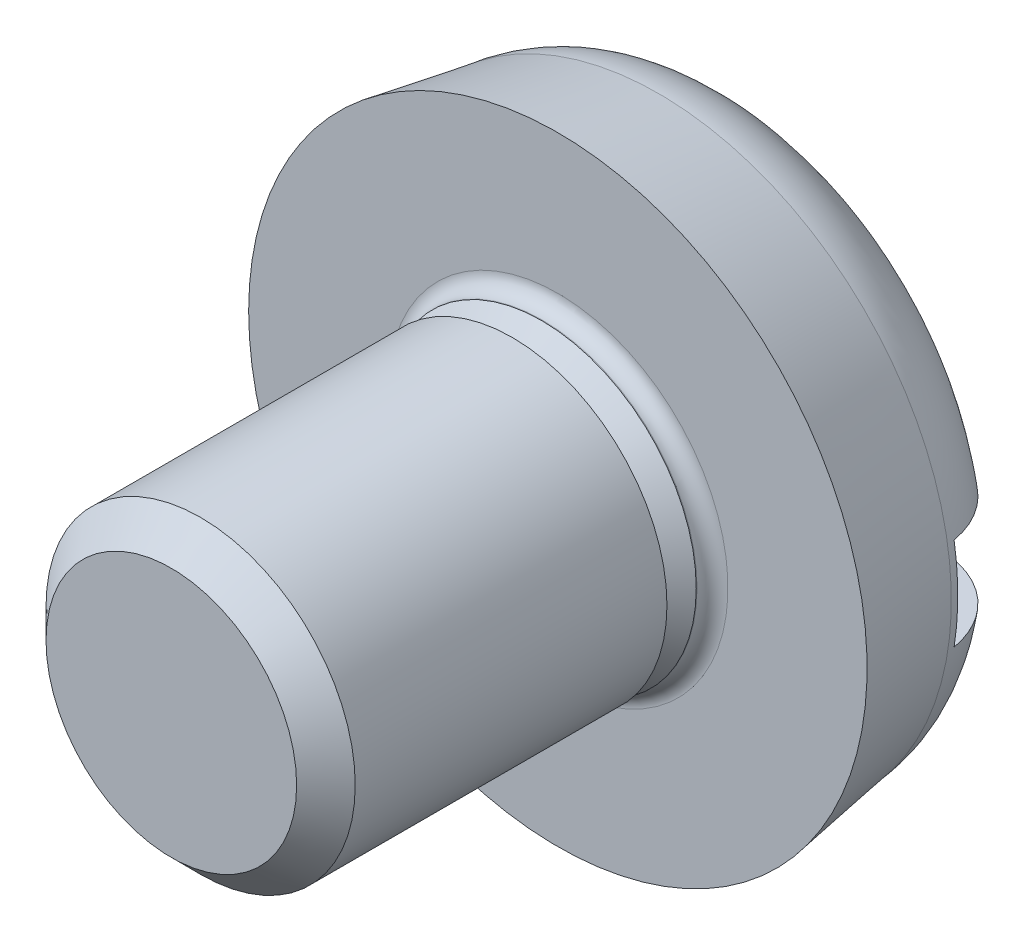
ISO-10303-21;
HEADER;
FILE_DESCRIPTION(('STEP AP214'),'2;1');
FILE_NAME('part.step','',(''),(''),'','','');
FILE_SCHEMA(('AUTOMOTIVE_DESIGN { 1 0 10303 214 1 1 1 1 }'));
ENDSEC;
DATA;
#1=APPLICATION_CONTEXT('core data for automotive mechanical design processes');
#2=APPLICATION_PROTOCOL_DEFINITION('international standard','automotive_design',2000,#1);
#3=PRODUCT_CONTEXT('',#1,'mechanical');
#4=PRODUCT('Part','Part','',(#3));
#5=PRODUCT_RELATED_PRODUCT_CATEGORY('part','',(#4));
#6=PRODUCT_DEFINITION_FORMATION('','',#4);
#7=PRODUCT_DEFINITION_CONTEXT('part definition',#1,'design');
#8=PRODUCT_DEFINITION('design','',#6,#7);
#9=PRODUCT_DEFINITION_SHAPE('','',#8);
#10=(LENGTH_UNIT() NAMED_UNIT(*) SI_UNIT(.MILLI.,.METRE.));
#11=(NAMED_UNIT(*) PLANE_ANGLE_UNIT() SI_UNIT($,.RADIAN.));
#12=(NAMED_UNIT(*) SI_UNIT($,.STERADIAN.) SOLID_ANGLE_UNIT());
#13=UNCERTAINTY_MEASURE_WITH_UNIT(LENGTH_MEASURE(1.E-05),#10,'distance_accuracy_value','');
#14=(GEOMETRIC_REPRESENTATION_CONTEXT(3) GLOBAL_UNCERTAINTY_ASSIGNED_CONTEXT((#13)) GLOBAL_UNIT_ASSIGNED_CONTEXT((#10,
#11,#12)) REPRESENTATION_CONTEXT('',''));
#15=CARTESIAN_POINT('',(0.,0.,0.));
#16=DIRECTION('',(0.,0.,1.));
#17=DIRECTION('',(1.,0.,0.));
#18=AXIS2_PLACEMENT_3D('',#15,#16,#17);
#19=CARTESIAN_POINT('',(0.,0.,0.));
#20=DIRECTION('',(0.,0.,-1.));
#21=DIRECTION('',(-1.,0.,0.));
#22=AXIS2_PLACEMENT_3D('',#19,#20,#21);
#23=PLANE('',#22);
#24=DIRECTION('',(-1.,0.,0.));
#25=VECTOR('',#24,1.);
#26=CARTESIAN_POINT('',(0.,-0.6,0.));
#27=LINE('',#26,#25);
#28=CARTESIAN_POINT('',(2.51957157782548,-0.6,0.));
#29=VERTEX_POINT('',#28);
#30=CARTESIAN_POINT('',(-2.51957157782548,-0.6,0.));
#31=VERTEX_POINT('',#30);
#32=EDGE_CURVE('E39',#29,#31,#27,.T.);
#33=ORIENTED_EDGE('',*,*,#32,.F.);
#34=CARTESIAN_POINT('',(0.,0.,0.));
#35=DIRECTION('',(0.,0.,-1.));
#36=DIRECTION('',(-1.,0.,0.));
#37=AXIS2_PLACEMENT_3D('',#34,#35,#36);
#38=CIRCLE('',#37,2.59002720753779);
#39=EDGE_CURVE('E130',#29,#31,#38,.T.);
#40=ORIENTED_EDGE('',*,*,#39,.T.);
#41=EDGE_LOOP('',(#33,#40));
#42=FACE_BOUND('',#41,.T.);
#43=ADVANCED_FACE('F15',(#42),#23,.T.);
#44=CARTESIAN_POINT('',(0.,0.,7.4));
#45=DIRECTION('',(0.,0.,-1.));
#46=DIRECTION('',(-1.,0.,0.));
#47=AXIS2_PLACEMENT_3D('',#44,#45,#46);
#48=PLANE('',#47);
#49=CARTESIAN_POINT('',(0.,0.,7.4));
#50=DIRECTION('',(0.,0.,-1.));
#51=DIRECTION('',(-1.,0.,0.));
#52=AXIS2_PLACEMENT_3D('',#49,#50,#51);
#53=CIRCLE('',#52,1.621125);
#54=CARTESIAN_POINT('',(-1.621125,0.,7.4));
#55=VERTEX_POINT('',#54);
#56=EDGE_CURVE('E89',#55,#55,#53,.T.);
#57=ORIENTED_EDGE('',*,*,#56,.F.);
#58=EDGE_LOOP('',(#57));
#59=FACE_BOUND('',#58,.T.);
#60=ADVANCED_FACE('F17',(#59),#48,.F.);
#61=CARTESIAN_POINT('',(0.,0.,7.4));
#62=DIRECTION('',(0.,0.,-1.));
#63=DIRECTION('',(-1.,0.,0.));
#64=AXIS2_PLACEMENT_3D('',#61,#62,#63);
#65=CONICAL_SURFACE('',#64,1.621125,0.785398163397449);
#66=CARTESIAN_POINT('',(0.,0.,7.021125));
#67=DIRECTION('',(0.,0.,-1.));
#68=DIRECTION('',(-1.,0.,0.));
#69=AXIS2_PLACEMENT_3D('',#66,#67,#68);
#70=CIRCLE('',#69,2.);
#71=CARTESIAN_POINT('',(-2.,0.,7.021125));
#72=VERTEX_POINT('',#71);
#73=EDGE_CURVE('E95',#72,#72,#70,.T.);
#74=ORIENTED_EDGE('',*,*,#73,.F.);
#75=EDGE_LOOP('',(#74));
#76=FACE_BOUND('',#75,.T.);
#77=ORIENTED_EDGE('',*,*,#56,.T.);
#78=EDGE_LOOP('',(#77));
#79=FACE_BOUND('',#78,.T.);
#80=ADVANCED_FACE('F162',(#76,#79),#65,.T.);
#81=CARTESIAN_POINT('',(0.,0.,0.));
#82=DIRECTION('',(0.,0.,-1.));
#83=DIRECTION('',(-1.,0.,0.));
#84=AXIS2_PLACEMENT_3D('',#81,#82,#83);
#85=CYLINDRICAL_SURFACE('',#84,2.);
#86=CARTESIAN_POINT('',(0.,0.,2.988875));
#87=DIRECTION('',(0.,0.,-1.));
#88=DIRECTION('',(-1.,0.,0.));
#89=AXIS2_PLACEMENT_3D('',#86,#87,#88);
#90=CIRCLE('',#89,2.);
#91=CARTESIAN_POINT('',(-2.,0.,2.988875));
#92=VERTEX_POINT('',#91);
#93=EDGE_CURVE('E99',#92,#92,#90,.T.);
#94=ORIENTED_EDGE('',*,*,#93,.F.);
#95=EDGE_LOOP('',(#94));
#96=FACE_BOUND('',#95,.T.);
#97=ORIENTED_EDGE('',*,*,#73,.T.);
#98=EDGE_LOOP('',(#97));
#99=FACE_BOUND('',#98,.T.);
#100=ADVANCED_FACE('F179',(#96,#99),#85,.T.);
#101=CARTESIAN_POINT('',(0.,2.,2.988875));
#102=DIRECTION('',(0.,0.,1.));
#103=DIRECTION('',(1.,0.,0.));
#104=AXIS2_PLACEMENT_3D('',#101,#102,#103);
#105=PLANE('',#104);
#106=CARTESIAN_POINT('',(0.,0.,2.988875));
#107=DIRECTION('',(0.,0.,-1.));
#108=DIRECTION('',(-1.,0.,0.));
#109=AXIS2_PLACEMENT_3D('',#106,#107,#108);
#110=CIRCLE('',#109,1.621125);
#111=CARTESIAN_POINT('',(-1.621125,0.,2.988875));
#112=VERTEX_POINT('',#111);
#113=EDGE_CURVE('E103',#112,#112,#110,.T.);
#114=ORIENTED_EDGE('',*,*,#113,.F.);
#115=EDGE_LOOP('',(#114));
#116=FACE_BOUND('',#115,.T.);
#117=ORIENTED_EDGE('',*,*,#93,.T.);
#118=EDGE_LOOP('',(#117));
#119=FACE_BOUND('',#118,.T.);
#120=ADVANCED_FACE('F188',(#116,#119),#105,.F.);
#121=CARTESIAN_POINT('',(0.,0.,2.988875));
#122=DIRECTION('',(0.,0.,-1.));
#123=DIRECTION('',(-1.,0.,0.));
#124=AXIS2_PLACEMENT_3D('',#121,#122,#123);
#125=CONICAL_SURFACE('',#124,1.621125,0.785398163397449);
#126=CARTESIAN_POINT('',(0.,0.,2.61));
#127=DIRECTION('',(0.,0.,-1.));
#128=DIRECTION('',(-1.,0.,0.));
#129=AXIS2_PLACEMENT_3D('',#126,#127,#128);
#130=CIRCLE('',#129,2.);
#131=CARTESIAN_POINT('',(-2.,0.,2.61));
#132=VERTEX_POINT('',#131);
#133=EDGE_CURVE('E107',#132,#132,#130,.T.);
#134=ORIENTED_EDGE('',*,*,#133,.F.);
#135=EDGE_LOOP('',(#134));
#136=FACE_BOUND('',#135,.T.);
#137=ORIENTED_EDGE('',*,*,#113,.T.);
#138=EDGE_LOOP('',(#137));
#139=FACE_BOUND('',#138,.T.);
#140=ADVANCED_FACE('F198',(#136,#139),#125,.T.);
#141=CARTESIAN_POINT('',(0.,0.,0.));
#142=DIRECTION('',(0.,0.,-1.));
#143=DIRECTION('',(-1.,0.,0.));
#144=AXIS2_PLACEMENT_3D('',#141,#142,#143);
#145=CYLINDRICAL_SURFACE('',#144,2.);
#146=CARTESIAN_POINT('',(0.,0.,2.6));
#147=DIRECTION('',(0.,0.,-1.));
#148=DIRECTION('',(-1.,0.,0.));
#149=AXIS2_PLACEMENT_3D('',#146,#147,#148);
#150=CIRCLE('',#149,2.);
#151=CARTESIAN_POINT('',(-2.,0.,2.6));
#152=VERTEX_POINT('',#151);
#153=EDGE_CURVE('E111',#152,#152,#150,.T.);
#154=ORIENTED_EDGE('',*,*,#153,.F.);
#155=EDGE_LOOP('',(#154));
#156=FACE_BOUND('',#155,.T.);
#157=ORIENTED_EDGE('',*,*,#133,.T.);
#158=EDGE_LOOP('',(#157));
#159=FACE_BOUND('',#158,.T.);
#160=ADVANCED_FACE('F208',(#156,#159),#145,.T.);
#161=CARTESIAN_POINT('',(0.,0.,2.6));
#162=DIRECTION('',(0.,0.,-1.));
#163=DIRECTION('',(-1.,0.,0.));
#164=AXIS2_PLACEMENT_3D('',#161,#162,#163);
#165=TOROIDAL_SURFACE('',#164,2.2,0.2);
#166=ORIENTED_EDGE('',*,*,#153,.T.);
#167=EDGE_LOOP('',(#166));
#168=FACE_BOUND('',#167,.T.);
#169=CARTESIAN_POINT('',(0.,0.,2.4));
#170=DIRECTION('',(0.,0.,-1.));
#171=DIRECTION('',(-1.,0.,0.));
#172=AXIS2_PLACEMENT_3D('',#169,#170,#171);
#173=CIRCLE('',#172,2.2);
#174=CARTESIAN_POINT('',(-2.2,0.,2.4));
#175=VERTEX_POINT('',#174);
#176=EDGE_CURVE('E115',#175,#175,#173,.T.);
#177=ORIENTED_EDGE('',*,*,#176,.F.);
#178=EDGE_LOOP('',(#177));
#179=FACE_BOUND('',#178,.T.);
#180=ADVANCED_FACE('F218',(#168,#179),#165,.F.);
#181=CARTESIAN_POINT('',(0.,2.2,2.4));
#182=DIRECTION('',(0.,0.,-1.));
#183=DIRECTION('',(-1.,0.,0.));
#184=AXIS2_PLACEMENT_3D('',#181,#182,#183);
#185=PLANE('',#184);
#186=CARTESIAN_POINT('',(0.,0.,2.4));
#187=DIRECTION('',(0.,0.,-1.));
#188=DIRECTION('',(-1.,0.,0.));
#189=AXIS2_PLACEMENT_3D('',#186,#187,#188);
#190=CIRCLE('',#189,4.);
#191=CARTESIAN_POINT('',(-4.,0.,2.4));
#192=VERTEX_POINT('',#191);
#193=EDGE_CURVE('E119',#192,#192,#190,.T.);
#194=ORIENTED_EDGE('',*,*,#193,.F.);
#195=EDGE_LOOP('',(#194));
#196=FACE_BOUND('',#195,.T.);
#197=ORIENTED_EDGE('',*,*,#176,.T.);
#198=EDGE_LOOP('',(#197));
#199=FACE_BOUND('',#198,.T.);
#200=ADVANCED_FACE('F228',(#196,#199),#185,.F.);
#201=CARTESIAN_POINT('',(0.,0.,2.4));
#202=DIRECTION('',(0.,0.,1.));
#203=DIRECTION('',(1.,0.,0.));
#204=AXIS2_PLACEMENT_3D('',#201,#202,#203);
#205=CONICAL_SURFACE('',#204,4.,0.162991029402412);
#206=CARTESIAN_POINT('',(0.,0.,1.09541310870281));
#207=DIRECTION('',(0.,0.,-1.));
#208=DIRECTION('',(-1.,0.,0.));
#209=AXIS2_PLACEMENT_3D('',#206,#207,#208);
#210=CIRCLE('',#209,3.78546084524788);
#211=CARTESIAN_POINT('',(-3.78546084524788,0.,1.09541310870281));
#212=VERTEX_POINT('',#211);
#213=EDGE_CURVE('E123',#212,#212,#210,.T.);
#214=ORIENTED_EDGE('',*,*,#213,.F.);
#215=EDGE_LOOP('',(#214));
#216=FACE_BOUND('',#215,.T.);
#217=ORIENTED_EDGE('',*,*,#193,.T.);
#218=EDGE_LOOP('',(#217));
#219=FACE_BOUND('',#218,.T.);
#220=ADVANCED_FACE('F156',(#216,#219),#205,.T.);
#221=CARTESIAN_POINT('',(0.,0.,1.2));
#222=DIRECTION('',(0.,0.,-1.));
#223=DIRECTION('',(-1.,0.,0.));
#224=AXIS2_PLACEMENT_3D('',#221,#222,#223);
#225=TOROIDAL_SURFACE('',#224,2.59002720753779,1.2);
#226=CARTESIAN_POINT('',(0.,0.,1.));
#227=DIRECTION('',(0.,0.,1.));
#228=DIRECTION('',(1.,0.,0.));
#229=AXIS2_PLACEMENT_3D('',#226,#227,#228);
#230=CIRCLE('',#229,3.77324316415771);
#231=CARTESIAN_POINT('',(-3.72523341226598,0.6,1.));
#232=VERTEX_POINT('',#231);
#233=CARTESIAN_POINT('',(-3.72523341226598,-0.6,1.));
#234=VERTEX_POINT('',#233);
#235=EDGE_CURVE('E9',#232,#234,#230,.T.);
#236=ORIENTED_EDGE('',*,*,#235,.T.);
#237=CARTESIAN_POINT('',(-1.4716932786523,-0.6,0.537769509744689));
#238=CARTESIAN_POINT('',(-1.43411203772367,-0.6,0.590359390353319));
#239=CARTESIAN_POINT('',(-1.40064484901736,-0.6,0.645920222238942));
#240=CARTESIAN_POINT('',(-1.34321814528723,-0.6,0.761793613923758));
#241=CARTESIAN_POINT('',(-1.3192607404451,-0.6,0.822107224790451));
#242=CARTESIAN_POINT('',(-1.28197241321526,-0.6,0.946181250869888));
#243=CARTESIAN_POINT('',(-1.2686764435198,-0.6,1.0099522774619));
#244=CARTESIAN_POINT('',(-1.25366012739821,-0.6,1.13883031818128));
#245=CARTESIAN_POINT('',(-1.25193430223703,-0.6,1.20393668534143));
#246=CARTESIAN_POINT('',(-1.25994440215119,-0.6,1.33010955034603));
#247=CARTESIAN_POINT('',(-1.26910455126585,-0.6,1.39121371784303));
#248=CARTESIAN_POINT('',(-1.29741549564402,-0.6,1.5110578869771));
#249=CARTESIAN_POINT('',(-1.31656870969437,-0.6,1.56979731252713));
#250=CARTESIAN_POINT('',(-1.36428977880284,-0.6,1.684308535825));
#251=CARTESIAN_POINT('',(-1.39299171734924,-0.6,1.74002410812468));
#252=CARTESIAN_POINT('',(-1.45860695771577,-0.6,1.84637956973118));
#253=CARTESIAN_POINT('',(-1.49552271375167,-0.6,1.89701793544007));
#254=CARTESIAN_POINT('',(-1.57998549546993,-0.6,1.99643614388522));
#255=CARTESIAN_POINT('',(-1.62817980513337,-0.6,2.04466647684574));
#256=CARTESIAN_POINT('',(-1.73154357503597,-0.6,2.13296617601196));
#257=CARTESIAN_POINT('',(-1.78671528464389,-0.6,2.17303289951458));
#258=CARTESIAN_POINT('',(-1.9063883295438,-0.6,2.24640011813588));
#259=CARTESIAN_POINT('',(-1.97126243775565,-0.6,2.27909456971135));
#260=CARTESIAN_POINT('',(-2.1055430861387,-0.6,2.33326316308238));
#261=CARTESIAN_POINT('',(-2.17495005572452,-0.6,2.35473624009626));
#262=CARTESIAN_POINT('',(-2.31712612753399,-0.6,2.38590789894634));
#263=CARTESIAN_POINT('',(-2.3899226159758,-0.6,2.39548216725083));
#264=CARTESIAN_POINT('',(-2.53608331162634,-0.6,2.40199604804472));
#265=CARTESIAN_POINT('',(-2.60944746827103,-0.6,2.3989367732035));
#266=CARTESIAN_POINT('',(-2.75301926629484,-0.6,2.3802968736456));
#267=CARTESIAN_POINT('',(-2.82326082274585,-0.6,2.36497799519665));
#268=CARTESIAN_POINT('',(-2.96004676020822,-0.6,2.32244163766758));
#269=CARTESIAN_POINT('',(-3.02659166244472,-0.6,2.29522584086692));
#270=CARTESIAN_POINT('',(-3.15222495881766,-0.6,2.23045938508562));
#271=CARTESIAN_POINT('',(-3.21146382463433,-0.6,2.19320053180703));
#272=CARTESIAN_POINT('',(-3.32266435909156,-0.6,2.10906254613797));
#273=CARTESIAN_POINT('',(-3.37462692165954,-0.6,2.06218459724539));
#274=CARTESIAN_POINT('',(-3.4686405915147,-0.6,1.9612341671975));
#275=CARTESIAN_POINT('',(-3.51087951410994,-0.6,1.90733652757654));
#276=CARTESIAN_POINT('',(-3.58555369992212,-0.6,1.79313044619969));
#277=CARTESIAN_POINT('',(-3.61798979784373,-0.6,1.73282255086466));
#278=CARTESIAN_POINT('',(-3.67167547442241,-0.6,1.60843758215124));
#279=CARTESIAN_POINT('',(-3.693077558026,-0.6,1.54442629670275));
#280=CARTESIAN_POINT('',(-3.72474000917552,-0.6,1.41370537877339));
#281=CARTESIAN_POINT('',(-3.73500093227191,-0.6,1.3469958810101));
#282=CARTESIAN_POINT('',(-3.74403650500127,-0.6,1.21330938791065));
#283=CARTESIAN_POINT('',(-3.74289694005408,-0.6,1.1463381753606));
#284=CARTESIAN_POINT('',(-3.72937240738968,-0.6,1.01354217392745));
#285=CARTESIAN_POINT('',(-3.71698764962596,-0.6,0.947717363663834));
#286=CARTESIAN_POINT('',(-3.68136850410861,-0.6,0.819173987557121));
#287=CARTESIAN_POINT('',(-3.65814946270989,-0.6,0.75645116640206));
#288=CARTESIAN_POINT('',(-3.60155600630531,-0.6,0.635770189615515));
#289=CARTESIAN_POINT('',(-3.56818150217924,-0.6,0.57781207580283));
#290=CARTESIAN_POINT('',(-3.49208535328325,-0.6,0.468011273472847));
#291=CARTESIAN_POINT('',(-3.44932231182917,-0.6,0.416197285640083));
#292=CARTESIAN_POINT('',(-3.35578736626251,-0.6,0.3203925632222));
#293=CARTESIAN_POINT('',(-3.30501515662831,-0.6,0.276402127214332));
#294=CARTESIAN_POINT('',(-3.19634077120165,-0.6,0.196969818247714));
#295=CARTESIAN_POINT('',(-3.13836832857922,-0.6,0.161624120358609));
#296=CARTESIAN_POINT('',(-3.01739060407952,-0.6,0.100980651809439));
#297=CARTESIAN_POINT('',(-2.95438495401168,-0.6,0.0756836170418732));
#298=CARTESIAN_POINT('',(-2.82397478083548,-0.6,0.035363572103847));
#299=CARTESIAN_POINT('',(-2.7565130319343,-0.6,0.0205257845422081));
#300=CARTESIAN_POINT('',(-2.62007625848355,-0.6,0.00210665702919977));
#301=CARTESIAN_POINT('',(-2.5511011290045,-0.6,-0.00147389990836761));
#302=CARTESIAN_POINT('',(-2.41186495150827,-0.6,0.00261678826882983));
#303=CARTESIAN_POINT('',(-2.34161176716528,-0.6,0.0105543769657223));
#304=CARTESIAN_POINT('',(-2.20333234603864,-0.6,0.0378051592626445));
#305=CARTESIAN_POINT('',(-2.13530689710048,-0.6,0.0571223323920924));
#306=CARTESIAN_POINT('',(-2.00154454395225,-0.6,0.10715717937032));
#307=CARTESIAN_POINT('',(-1.93591479103223,-0.6,0.138161165626175));
#308=CARTESIAN_POINT('',(-1.81072142636531,-0.6,0.210585075869065));
#309=CARTESIAN_POINT('',(-1.75115347096754,-0.6,0.251997466700401));
#310=CARTESIAN_POINT('',(-1.65323182125406,-0.6,0.333004130292251));
#311=CARTESIAN_POINT('',(-1.61322831224931,-0.6,0.370623918843219));
#312=CARTESIAN_POINT('',(-1.53839488224894,-0.6,0.450706926945101));
#313=CARTESIAN_POINT('',(-1.50356463591233,-0.6,0.493169841619769));
#314=CARTESIAN_POINT('',(-1.4716932786523,-0.6,0.537769509744689));
#315=B_SPLINE_CURVE_WITH_KNOTS('',3,(#237,#238,#239,#240,#241,#242,#243,#244,#245,#246,#247,
#248,#249,#250,#251,#252,#253,#254,#255,#256,#257,#258,#259,#260,#261,#262,#263,#264,#265,#266,
#267,#268,#269,#270,#271,#272,#273,#274,#275,#276,#277,#278,#279,#280,#281,#282,#283,#284,#285,
#286,#287,#288,#289,#290,#291,#292,#293,#294,#295,#296,#297,#298,#299,#300,#301,#302,#303,#304,
#305,#306,#307,#308,#309,#310,#311,#312,#313,#314),.UNSPECIFIED.,.T.,.F.,(4,2,2,2,2,2,2,2,2,2,2,
2,2,2,2,2,2,2,2,2,2,2,2,2,2,2,2,2,2,2,2,2,2,2,2,2,2,2,4),(0.,0.193738667633547,0.38752030107627,
0.581934664542111,0.776256961736792,0.960742588647089,1.14527289039629,1.33251218289787,
1.51980749614572,1.72347697559221,1.92721228202298,2.14413856356626,2.36108542522713,
2.5802803013824,2.79945587287991,3.01407296286546,3.22865971481047,3.43758143084845,
3.64647745732878,3.85091650125696,4.05533813241495,4.25685305738469,4.45835793341433,
4.65834769010802,4.85833371296726,5.05803731908509,5.25774267777089,5.45834693981724,
5.65895885606257,5.86171032111959,6.06447663151332,6.2707491774293,6.47703607062863,
6.68816978225353,6.89937737285203,7.11613648387366,7.33273916347142,7.49705259881573,
7.66135569628279),.UNSPECIFIED.);
#316=EDGE_CURVE('E66',#234,#31,#315,.T.);
#317=ORIENTED_EDGE('',*,*,#316,.T.);
#318=ORIENTED_EDGE('',*,*,#39,.F.);
#319=CARTESIAN_POINT('',(3.42739059832485,-0.6,0.394508751913592));
#320=CARTESIAN_POINT('',(3.47273732448832,-0.6,0.443838180165115));
#321=CARTESIAN_POINT('',(3.5139819322736,-0.6,0.497001291176222));
#322=CARTESIAN_POINT('',(3.587010438049,-0.6,0.609531008254611));
#323=CARTESIAN_POINT('',(3.61878399669516,-0.6,0.668904299051932));
#324=CARTESIAN_POINT('',(3.67188075306022,-0.6,0.792152565065327));
#325=CARTESIAN_POINT('',(3.69320526119823,-0.6,0.856026974644701));
#326=CARTESIAN_POINT('',(3.72475829549976,-0.6,0.986444411260961));
#327=CARTESIAN_POINT('',(3.73498942232364,-0.6,1.05298680903713));
#328=CARTESIAN_POINT('',(3.74403410533907,-0.6,1.18650331181347));
#329=CARTESIAN_POINT('',(3.74290531035945,-0.6,1.25347351517294));
#330=CARTESIAN_POINT('',(3.7294021858728,-0.6,1.38627125495123));
#331=CARTESIAN_POINT('',(3.71702768912223,-0.6,1.45209877436148));
#332=CARTESIAN_POINT('',(3.68142856004191,-0.6,1.58064848200349));
#333=CARTESIAN_POINT('',(3.65821940985802,-0.6,1.64337496047501));
#334=CARTESIAN_POINT('',(3.60164496751511,-0.6,1.76406475604206));
#335=CARTESIAN_POINT('',(3.56827959560591,-0.6,1.82202803573076));
#336=CARTESIAN_POINT('',(3.49220078289252,-0.6,1.93184054843834));
#337=CARTESIAN_POINT('',(3.449445953264,-0.6,1.98366109583799));
#338=CARTESIAN_POINT('',(3.35592628977758,-0.6,2.07948007897472));
#339=CARTESIAN_POINT('',(3.30516116626178,-0.6,2.12347823172604));
#340=CARTESIAN_POINT('',(3.19649962550614,-0.6,2.2029270918839));
#341=CARTESIAN_POINT('',(3.13853292603295,-0.6,2.23828163457542));
#342=CARTESIAN_POINT('',(3.0175653796527,-0.6,2.29894344318991));
#343=CARTESIAN_POINT('',(2.95456418512597,-0.6,2.3242500146035));
#344=CARTESIAN_POINT('',(2.82416271464564,-0.6,2.36458943346011));
#345=CARTESIAN_POINT('',(2.75670525479672,-0.6,2.37943729566112));
#346=CARTESIAN_POINT('',(2.62027273658557,-0.6,2.39787776039144));
#347=CARTESIAN_POINT('',(2.55129751376321,-0.6,2.40146913709449));
#348=CARTESIAN_POINT('',(2.41205325051599,-0.6,2.39739949347502));
#349=CARTESIAN_POINT('',(2.34179205528114,-0.6,2.38947113279146));
#350=CARTESIAN_POINT('',(2.20351113231143,-0.6,2.36224007328761));
#351=CARTESIAN_POINT('',(2.13549171635706,-0.6,2.34293579932655));
#352=CARTESIAN_POINT('',(2.0017601904999,-0.6,2.2929347409736));
#353=CARTESIAN_POINT('',(1.93615351872805,-0.6,2.26195574952765));
#354=CARTESIAN_POINT('',(1.81095283451277,-0.6,2.18956989586742));
#355=CARTESIAN_POINT('',(1.75136017515386,-0.6,2.14816069426796));
#356=CARTESIAN_POINT('',(1.63915443703713,-0.6,2.0553631923402));
#357=CARTESIAN_POINT('',(1.58664532404582,-0.6,2.00384887760091));
#358=CARTESIAN_POINT('',(1.49132812171005,-0.6,1.89248084845915));
#359=CARTESIAN_POINT('',(1.44851984674948,-0.6,1.83262729365534));
#360=CARTESIAN_POINT('',(1.37561449947789,-0.6,1.70814982399793));
#361=CARTESIAN_POINT('',(1.34515572831249,-0.6,1.64373879642716));
#362=CARTESIAN_POINT('',(1.29669771477614,-0.6,1.51040281022181));
#363=CARTESIAN_POINT('',(1.27868637865325,-0.6,1.44148230442238));
#364=CARTESIAN_POINT('',(1.25730891804116,-0.6,1.30766523011685));
#365=CARTESIAN_POINT('',(1.25278755008945,-0.6,1.24295249674452));
#366=CARTESIAN_POINT('',(1.2553736416742,-0.6,1.11376848300547));
#367=CARTESIAN_POINT('',(1.26247826735688,-0.6,1.04929714763672));
#368=CARTESIAN_POINT('',(1.28716304831934,-0.6,0.926049593633758));
#369=CARTESIAN_POINT('',(1.30415666475395,-0.6,0.867153853263281));
#370=CARTESIAN_POINT('',(1.3472844235497,-0.6,0.752817946956514));
#371=CARTESIAN_POINT('',(1.37342091785149,-0.6,0.697378674499886));
#372=CARTESIAN_POINT('',(1.43542961101891,-0.6,0.588260631903495));
#373=CARTESIAN_POINT('',(1.47175028382082,-0.6,0.534837426003086));
#374=CARTESIAN_POINT('',(1.55215748955631,-0.6,0.434200876257205));
#375=CARTESIAN_POINT('',(1.59624665586535,-0.6,0.386989647666512));
#376=CARTESIAN_POINT('',(1.69515366681681,-0.6,0.295855322015281));
#377=CARTESIAN_POINT('',(1.75057341920977,-0.6,0.25258411600749));
#378=CARTESIAN_POINT('',(1.86764292573719,-0.6,0.175493131524813));
#379=CARTESIAN_POINT('',(1.92929424753539,-0.6,0.141675739425121));
#380=CARTESIAN_POINT('',(2.05998768306573,-0.6,0.0831431047028063));
#381=CARTESIAN_POINT('',(2.12923344752397,-0.6,0.0588808649470352));
#382=CARTESIAN_POINT('',(2.27082988436815,-0.6,0.0223958017413388));
#383=CARTESIAN_POINT('',(2.34318045187567,-0.6,0.0101725719542671));
#384=CARTESIAN_POINT('',(2.48849586686531,-0.6,-0.00169116073633957));
#385=CARTESIAN_POINT('',(2.56145480323373,-0.6,-0.00140349755542032));
#386=CARTESIAN_POINT('',(2.70625486102758,-0.6,0.0117496490506274));
#387=CARTESIAN_POINT('',(2.77809582716349,-0.6,0.0246168642483211));
#388=CARTESIAN_POINT('',(2.91668708538043,-0.6,0.0622303680919502));
#389=CARTESIAN_POINT('',(2.9835192763507,-0.6,0.0866754851977579));
#390=CARTESIAN_POINT('',(3.11190615412333,-0.6,0.14671121322156));
#391=CARTESIAN_POINT('',(3.17346811065707,-0.6,0.18228614562193));
#392=CARTESIAN_POINT('',(3.26705614196316,-0.6,0.24788213746375));
#393=CARTESIAN_POINT('',(3.30132458816245,-0.6,0.274763551588802));
#394=CARTESIAN_POINT('',(3.36676875827785,-0.6,0.332060759176853));
#395=CARTESIAN_POINT('',(3.39794452869241,-0.6,0.362476499486242));
#396=CARTESIAN_POINT('',(3.42739059832485,-0.6,0.394508751913592));
#397=B_SPLINE_CURVE_WITH_KNOTS('',3,(#319,#320,#321,#322,#323,#324,#325,#326,#327,#328,#329,
#330,#331,#332,#333,#334,#335,#336,#337,#338,#339,#340,#341,#342,#343,#344,#345,#346,#347,#348,
#349,#350,#351,#352,#353,#354,#355,#356,#357,#358,#359,#360,#361,#362,#363,#364,#365,#366,#367,
#368,#369,#370,#371,#372,#373,#374,#375,#376,#377,#378,#379,#380,#381,#382,#383,#384,#385,#386,
#387,#388,#389,#390,#391,#392,#393,#394,#395,#396),.UNSPECIFIED.,.T.,.F.,(4,2,2,2,2,2,2,2,2,2,2,
2,2,2,2,2,2,2,2,2,2,2,2,2,2,2,2,2,2,2,2,2,2,2,2,2,2,2,4),(0.,0.200858907639673,0.40193629232685,
0.60298845337016,0.803993470851439,1.00397895342869,1.2039674101934,1.40367096470957,
1.60337608740793,1.80397984261366,2.0045908534564,2.20734141800614,2.41010599410732,
2.61637250124901,2.82266146994126,3.03381494879324,3.24499767141858,3.46165186629216,
3.6783546977342,3.89795474934254,4.11755059876203,4.33014632128844,4.54253519732138,
4.73612373663724,4.92966509547801,5.1127527565387,5.29588755028157,5.48888408491984,
5.68194616811569,5.89194658145925,6.10199995630659,6.32106956913066,6.54013178772776,
6.75793638162598,6.97577096396422,7.18822662886713,7.40038434594063,7.53081480521735,
7.66124330317176),.UNSPECIFIED.);
#398=CARTESIAN_POINT('',(3.72523341226598,-0.6,1.));
#399=VERTEX_POINT('',#398);
#400=EDGE_CURVE('E79',#29,#399,#397,.T.);
#401=ORIENTED_EDGE('',*,*,#400,.T.);
#402=CARTESIAN_POINT('',(3.72523341226598,0.6,1.));
#403=VERTEX_POINT('',#402);
#404=EDGE_CURVE('E19',#399,#403,#230,.T.);
#405=ORIENTED_EDGE('',*,*,#404,.T.);
#406=CARTESIAN_POINT('',(3.42739059832485,0.6,0.394508751913592));
#407=CARTESIAN_POINT('',(3.38108477191552,0.6,0.34414533443048));
#408=CARTESIAN_POINT('',(3.33043068894705,0.6,0.297702241720475));
#409=CARTESIAN_POINT('',(3.22196394007269,0.6,0.213992014043367));
#410=CARTESIAN_POINT('',(3.16414119839779,0.6,0.176738019462845));
#411=CARTESIAN_POINT('',(3.04315654969892,0.6,0.112469852217801));
#412=CARTESIAN_POINT('',(2.9800017235346,0.6,0.0854423527347746));
#413=CARTESIAN_POINT('',(2.85012018959228,0.6,0.0422066926056342));
#414=CARTESIAN_POINT('',(2.78339440842862,0.6,0.0259957397759612));
#415=CARTESIAN_POINT('',(2.64715525755328,0.6,0.00451908045718028));
#416=CARTESIAN_POINT('',(2.57761479986856,0.6,-0.000574477331129739));
#417=CARTESIAN_POINT('',(2.43863665171179,0.6,0.000677768272000553));
#418=CARTESIAN_POINT('',(2.36919898061438,0.6,0.00702550694954505));
#419=CARTESIAN_POINT('',(2.23051132347593,0.6,0.0311541488729134));
#420=CARTESIAN_POINT('',(2.16131142616473,0.6,0.0492229194551984));
#421=CARTESIAN_POINT('',(2.02680347872598,0.6,0.0964506540864661));
#422=CARTESIAN_POINT('',(1.96149603537282,0.6,0.125611341993837));
#423=CARTESIAN_POINT('',(1.83504802092357,0.6,0.194991488145853));
#424=CARTESIAN_POINT('',(1.77403988913742,0.6,0.235452645334467));
#425=CARTESIAN_POINT('',(1.65965886125682,0.6,0.326055785681326));
#426=CARTESIAN_POINT('',(1.60628782308802,0.6,0.376200117581361));
#427=CARTESIAN_POINT('',(1.50900971031593,0.6,0.484839328354059));
#428=CARTESIAN_POINT('',(1.46508794259191,0.6,0.543321004151737));
#429=CARTESIAN_POINT('',(1.38840696443799,0.6,0.667207000610986));
#430=CARTESIAN_POINT('',(1.35564227107929,0.6,0.732607900181571));
#431=CARTESIAN_POINT('',(1.30462028000072,0.6,0.864341488400804));
#432=CARTESIAN_POINT('',(1.28560720102055,0.6,0.930380085777575));
#433=CARTESIAN_POINT('',(1.26018608607806,0.6,1.06482262140763));
#434=CARTESIAN_POINT('',(1.25376737792062,0.6,1.13322450699553));
#435=CARTESIAN_POINT('',(1.25395478228387,0.6,1.26386275127897));
#436=CARTESIAN_POINT('',(1.25944743566337,0.6,1.32610344150615));
#437=CARTESIAN_POINT('',(1.28089550764059,0.6,1.44875073481582));
#438=CARTESIAN_POINT('',(1.29685212567822,0.6,1.50915712680984));
#439=CARTESIAN_POINT('',(1.33824855534403,0.6,1.62615322980442));
#440=CARTESIAN_POINT('',(1.36362570093449,0.6,1.68276530680958));
#441=CARTESIAN_POINT('',(1.42281199186102,0.6,1.79138503906348));
#442=CARTESIAN_POINT('',(1.45662354382613,0.6,1.8433913743853));
#443=CARTESIAN_POINT('',(1.53466577966434,0.6,1.94585731191831));
#444=CARTESIAN_POINT('',(1.57952430225289,0.6,1.99583869536994));
#445=CARTESIAN_POINT('',(1.67647478652174,0.6,2.08821130104995));
#446=CARTESIAN_POINT('',(1.72856921855671,0.6,2.13059991972848));
#447=CARTESIAN_POINT('',(1.8426954700978,0.6,2.20967445010928));
#448=CARTESIAN_POINT('',(1.9051756976369,0.6,2.24571514635323));
#449=CARTESIAN_POINT('',(2.03521931407099,0.6,2.30702860963941));
#450=CARTESIAN_POINT('',(2.10278340346556,0.6,2.33229988956752));
#451=CARTESIAN_POINT('',(2.24248507230385,0.6,2.37166175360719));
#452=CARTESIAN_POINT('',(2.31468488425126,0.6,2.38553242686815));
#453=CARTESIAN_POINT('',(2.46039792751748,0.6,2.40072179207245));
#454=CARTESIAN_POINT('',(2.53391107156075,0.6,2.40204131499837));
#455=CARTESIAN_POINT('',(2.67876911021061,0.6,2.39200371145515));
#456=CARTESIAN_POINT('',(2.75012938197631,0.6,2.38086966272212));
#457=CARTESIAN_POINT('',(2.88985802002371,0.6,2.34644491721418));
#458=CARTESIAN_POINT('',(2.95822680458585,0.6,2.32315592591198));
#459=CARTESIAN_POINT('',(3.08809323168011,0.6,2.26576190816591));
#460=CARTESIAN_POINT('',(3.14972517503322,0.6,2.23196070699418));
#461=CARTESIAN_POINT('',(3.26626096111737,0.6,2.15426377202634));
#462=CARTESIAN_POINT('',(3.3211656547156,0.6,2.11036931685641));
#463=CARTESIAN_POINT('',(3.42139179359826,0.6,2.01481484138785));
#464=CARTESIAN_POINT('',(3.46690103197467,0.6,1.96335172063492));
#465=CARTESIAN_POINT('',(3.54847001910179,0.6,1.85341337689125));
#466=CARTESIAN_POINT('',(3.58453061431911,0.6,1.79493878271528));
#467=CARTESIAN_POINT('',(3.64561461261341,0.6,1.67361697558762));
#468=CARTESIAN_POINT('',(3.67079966917104,0.6,1.61085111366302));
#469=CARTESIAN_POINT('',(3.71016990399487,0.6,1.48196246418378));
#470=CARTESIAN_POINT('',(3.72435616126772,0.6,1.4158400065969));
#471=CARTESIAN_POINT('',(3.74122625687459,0.6,1.28273330286502));
#472=CARTESIAN_POINT('',(3.7440095256111,0.6,1.21576163662517));
#473=CARTESIAN_POINT('',(3.73826195494299,0.6,1.08228686090636));
#474=CARTESIAN_POINT('',(3.72972835950331,0.6,1.01578386953105));
#475=CARTESIAN_POINT('',(3.70163104965939,0.6,0.885293873223738));
#476=CARTESIAN_POINT('',(3.68208866363454,0.6,0.82130225842663));
#477=CARTESIAN_POINT('',(3.63258146862759,0.6,0.697553741356493));
#478=CARTESIAN_POINT('',(3.60263007333974,0.6,0.63779150756857));
#479=CARTESIAN_POINT('',(3.54762667397433,0.6,0.547701666139707));
#480=CARTESIAN_POINT('',(3.52568335106027,0.6,0.51543463768188));
#481=CARTESIAN_POINT('',(3.4787610162146,0.6,0.453190189953827));
#482=CARTESIAN_POINT('',(3.45378202672795,0.6,0.423212753757594));
#483=CARTESIAN_POINT('',(3.42739059832485,0.6,0.394508751913592));
#484=B_SPLINE_CURVE_WITH_KNOTS('',3,(#406,#407,#408,#409,#410,#411,#412,#413,#414,#415,#416,
#417,#418,#419,#420,#421,#422,#423,#424,#425,#426,#427,#428,#429,#430,#431,#432,#433,#434,#435,
#436,#437,#438,#439,#440,#441,#442,#443,#444,#445,#446,#447,#448,#449,#450,#451,#452,#453,#454,
#455,#456,#457,#458,#459,#460,#461,#462,#463,#464,#465,#466,#467,#468,#469,#470,#471,#472,#473,
#474,#475,#476,#477,#478,#479,#480,#481,#482,#483),.UNSPECIFIED.,.T.,.F.,(4,2,2,2,2,2,2,2,2,2,2,
2,2,2,2,2,2,2,2,2,2,2,2,2,2,2,2,2,2,2,2,2,2,2,2,2,2,2,4),(0.,0.20510134400532,0.410494303843588,
0.615618673117286,0.820690071075668,1.02891504067935,1.23717523467474,1.45075448569827,
1.66436694386774,1.88295350345682,2.10159314994692,2.31989032588338,2.5380800685417,
2.74311047525821,2.94796706851998,3.1345036041703,3.32106152545107,3.50640006125353,
3.69179154118794,3.89241630219351,4.09310972603885,4.30850484262458,4.5239296928,
4.74341841334679,4.9628926019527,5.17849748603106,5.39407212649217,5.60391891284369,
5.81373913017042,6.01883941014259,6.22392130970397,6.42584013687333,6.6277391528501,
6.82787387792101,7.02805735144481,7.22785431772874,7.42739476217401,7.54429058015329,
7.66118553388653),.UNSPECIFIED.);
#485=CARTESIAN_POINT('',(2.51957157782548,0.6,0.));
#486=VERTEX_POINT('',#485);
#487=EDGE_CURVE('E56',#403,#486,#484,.T.);
#488=ORIENTED_EDGE('',*,*,#487,.T.);
#489=CARTESIAN_POINT('',(-2.51957157782548,0.6,0.));
#490=VERTEX_POINT('',#489);
#491=EDGE_CURVE('E127',#490,#486,#38,.T.);
#492=ORIENTED_EDGE('',*,*,#491,.F.);
#493=CARTESIAN_POINT('',(-1.4716932786523,0.6,0.537769509744689));
#494=CARTESIAN_POINT('',(-1.51361058928489,0.6,0.479117613942494));
#495=CARTESIAN_POINT('',(-1.5607094792897,0.6,0.424078982350758));
#496=CARTESIAN_POINT('',(-1.66355022634268,0.6,0.322636720138445));
#497=CARTESIAN_POINT('',(-1.71931022826478,0.6,0.276251678237129));
#498=CARTESIAN_POINT('',(-1.83763913939499,0.6,0.193429547470962));
#499=CARTESIAN_POINT('',(-1.90019537649334,0.6,0.156974374230879));
#500=CARTESIAN_POINT('',(-2.03043392762089,0.6,0.0949109160168818));
#501=CARTESIAN_POINT('',(-2.09811358444624,0.6,0.069297053142501));
#502=CARTESIAN_POINT('',(-2.23788801659597,0.6,0.0293658970425066));
#503=CARTESIAN_POINT('',(-2.31003535747115,0.6,0.015231906875824));
#504=CARTESIAN_POINT('',(-2.45569806138129,0.6,-0.000494095125701552));
#505=CARTESIAN_POINT('',(-2.5292134926727,0.6,-0.00208547949705573));
#506=CARTESIAN_POINT('',(-2.67413596676294,0.6,0.00741607665993954));
#507=CARTESIAN_POINT('',(-2.74555741371847,0.6,0.0182881164182508));
#508=CARTESIAN_POINT('',(-2.88545183998786,0.6,0.0522031675977058));
#509=CARTESIAN_POINT('',(-2.95392526949347,0.6,0.0752443134935667));
#510=CARTESIAN_POINT('',(-3.08403978011941,0.6,0.132171602939011));
#511=CARTESIAN_POINT('',(-3.14581402977086,0.6,0.165753431160214));
#512=CARTESIAN_POINT('',(-3.26266929102251,0.6,0.24303996920617));
#513=CARTESIAN_POINT('',(-3.31775117108687,0.6,0.286743363418605));
#514=CARTESIAN_POINT('',(-3.418353313154,0.6,0.381950900844724));
#515=CARTESIAN_POINT('',(-3.46406127261686,0.6,0.433256786498478));
#516=CARTESIAN_POINT('',(-3.54605078601804,0.6,0.542917350765868));
#517=CARTESIAN_POINT('',(-3.58233319466427,0.6,0.601271389550275));
#518=CARTESIAN_POINT('',(-3.6438703489209,0.6,0.722388102172431));
#519=CARTESIAN_POINT('',(-3.66928750552933,0.6,0.785068297588968));
#520=CARTESIAN_POINT('',(-3.70913343094597,0.6,0.913828904678571));
#521=CARTESIAN_POINT('',(-3.7235628214757,0.6,0.979909123741959));
#522=CARTESIAN_POINT('',(-3.74091924496842,0.6,1.11297677071696));
#523=CARTESIAN_POINT('',(-3.74394521233332,0.6,1.17995131233357));
#524=CARTESIAN_POINT('',(-3.73867887195688,0.6,1.3134529336886));
#525=CARTESIAN_POINT('',(-3.73038683649909,0.6,1.37998002415291));
#526=CARTESIAN_POINT('',(-3.70276830144866,0.6,1.5105267509703));
#527=CARTESIAN_POINT('',(-3.68346948781743,0.6,1.57455224958338));
#528=CARTESIAN_POINT('',(-3.63443196274279,0.6,1.69846987770979));
#529=CARTESIAN_POINT('',(-3.60469320862832,0.6,1.75836199032758));
#530=CARTESIAN_POINT('',(-3.53553383939647,0.6,1.87254523234202));
#531=CARTESIAN_POINT('',(-3.49608056651445,0.6,1.92681657329326));
#532=CARTESIAN_POINT('',(-3.4087013710921,0.6,2.02804183718581));
#533=CARTESIAN_POINT('',(-3.36077517257026,0.6,2.07499552168146));
#534=CARTESIAN_POINT('',(-3.25734127555064,0.6,2.16075041837508));
#535=CARTESIAN_POINT('',(-3.20176586358433,0.6,2.19946992477728));
#536=CARTESIAN_POINT('',(-3.08498678308659,0.6,2.26719684292877));
#537=CARTESIAN_POINT('',(-3.02378276519435,0.6,2.29620365130325));
#538=CARTESIAN_POINT('',(-2.89644545276634,0.6,2.34420395967966));
#539=CARTESIAN_POINT('',(-2.83024883636888,0.6,2.36302937247811));
#540=CARTESIAN_POINT('',(-2.69566789003089,0.6,2.38956519438689));
#541=CARTESIAN_POINT('',(-2.62728333918426,0.6,2.39727447750753));
#542=CARTESIAN_POINT('',(-2.48862430540131,0.6,2.40156299126916));
#543=CARTESIAN_POINT('',(-2.41834197655819,0.6,2.3978873349278));
#544=CARTESIAN_POINT('',(-2.27932460749326,0.6,2.37910231872183));
#545=CARTESIAN_POINT('',(-2.21058977598378,0.6,2.36399142597717));
#546=CARTESIAN_POINT('',(-2.07471055338614,0.6,2.32232366824967));
#547=CARTESIAN_POINT('',(-2.00765470098917,0.6,2.295477934734));
#548=CARTESIAN_POINT('',(-1.87887030972219,0.6,2.231107359315));
#549=CARTESIAN_POINT('',(-1.817142840003,0.6,2.19358038065956));
#550=CARTESIAN_POINT('',(-1.69970109506114,0.6,2.10809336384653));
#551=CARTESIAN_POINT('',(-1.64411173393561,0.6,2.05996137142064));
#552=CARTESIAN_POINT('',(-1.5419732592071,0.6,1.95486874843765));
#553=CARTESIAN_POINT('',(-1.49542524624806,0.6,1.8979070445158));
#554=CARTESIAN_POINT('',(-1.41403576190966,0.6,1.77785422014904));
#555=CARTESIAN_POINT('',(-1.37897104823469,0.6,1.71491513524864));
#556=CARTESIAN_POINT('',(-1.32099555792382,0.6,1.58367935692235));
#557=CARTESIAN_POINT('',(-1.29807347681465,0.6,1.51538771483757));
#558=CARTESIAN_POINT('',(-1.26714684203804,0.6,1.38138502314665));
#559=CARTESIAN_POINT('',(-1.258074353586,0.6,1.31592065175122));
#560=CARTESIAN_POINT('',(-1.25198056526001,0.6,1.18442441807839));
#561=CARTESIAN_POINT('',(-1.2549573581466,0.6,1.11839264726372));
#562=CARTESIAN_POINT('',(-1.27212661752848,0.6,0.992506691550813));
#563=CARTESIAN_POINT('',(-1.2855278321017,0.6,0.932541442657644));
#564=CARTESIAN_POINT('',(-1.32185213451765,0.6,0.815630204004857));
#565=CARTESIAN_POINT('',(-1.34476539562171,0.6,0.758681166511778));
#566=CARTESIAN_POINT('',(-1.38627411940299,0.6,0.674911884515581));
#567=CARTESIAN_POINT('',(-1.40182003909274,0.6,0.646534780588649));
#568=CARTESIAN_POINT('',(-1.43512767163365,0.6,0.591119354974699));
#569=CARTESIAN_POINT('',(-1.45288909523031,0.6,0.564080859162574));
#570=CARTESIAN_POINT('',(-1.4716932786523,0.6,0.537769509744689));
#571=B_SPLINE_CURVE_WITH_KNOTS('',3,(#493,#494,#495,#496,#497,#498,#499,#500,#501,#502,#503,
#504,#505,#506,#507,#508,#509,#510,#511,#512,#513,#514,#515,#516,#517,#518,#519,#520,#521,#522,
#523,#524,#525,#526,#527,#528,#529,#530,#531,#532,#533,#534,#535,#536,#537,#538,#539,#540,#541,
#542,#543,#544,#545,#546,#547,#548,#549,#550,#551,#552,#553,#554,#555,#556,#557,#558,#559,#560,
#561,#562,#563,#564,#565,#566,#567,#568,#569,#570),.UNSPECIFIED.,.T.,.F.,(4,2,2,2,2,2,2,2,2,2,2,
2,2,2,2,2,2,2,2,2,2,2,2,2,2,2,2,2,2,2,2,2,2,2,2,2,2,2,4),(0.,0.216149522145694,0.43275813801011,
0.648969585651337,0.865069655957099,1.0845559492929,1.30405322270441,1.51971950601057,
1.73535273724464,1.94525842482191,2.15513684392376,2.3602797688611,2.56540408496229,
2.76734485042235,2.96927418860507,3.16944753029248,3.3696160563822,3.56928329412088,
3.7689513479669,3.96930002603522,4.16965523109594,4.37191424785492,4.57418582707244,
4.77970204238623,4.98523907365814,5.19541068042144,5.40561046543418,5.62130479560957,
5.8370423051733,6.05657577160445,6.27613594610477,6.49113185849885,6.70592726199023,
6.90313204435087,7.10030561306298,7.28381997555397,7.46714522232211,7.56412294762209,
7.66108802481012),.UNSPECIFIED.);
#572=EDGE_CURVE('E31',#490,#232,#571,.T.);
#573=ORIENTED_EDGE('',*,*,#572,.T.);
#574=EDGE_LOOP('',(#236,#317,#318,#401,#405,#488,#492,#573));
#575=FACE_BOUND('',#574,.T.);
#576=ORIENTED_EDGE('',*,*,#213,.T.);
#577=EDGE_LOOP('',(#576));
#578=FACE_BOUND('',#577,.T.);
#579=ADVANCED_FACE('F76',(#575,#578),#225,.T.);
#580=DIRECTION('',(1.,0.,0.));
#581=VECTOR('',#580,1.);
#582=CARTESIAN_POINT('',(0.,0.6,0.));
#583=LINE('',#582,#581);
#584=EDGE_CURVE('E60',#490,#486,#583,.T.);
#585=ORIENTED_EDGE('',*,*,#584,.F.);
#586=ORIENTED_EDGE('',*,*,#491,.T.);
#587=EDGE_LOOP('',(#585,#586));
#588=FACE_BOUND('',#587,.T.);
#589=ADVANCED_FACE('F147',(#588),#23,.T.);
#590=CARTESIAN_POINT('',(5.,0.,1.));
#591=DIRECTION('',(0.,0.,1.));
#592=DIRECTION('',(1.,0.,0.));
#593=AXIS2_PLACEMENT_3D('',#590,#591,#592);
#594=PLANE('',#593);
#595=DIRECTION('',(-1.,0.,0.));
#596=VECTOR('',#595,1.);
#597=CARTESIAN_POINT('',(5.,0.6,1.));
#598=LINE('',#597,#596);
#599=EDGE_CURVE('E59',#403,#232,#598,.T.);
#600=ORIENTED_EDGE('',*,*,#599,.F.);
#601=ORIENTED_EDGE('',*,*,#404,.F.);
#602=DIRECTION('',(-1.,0.,0.));
#603=VECTOR('',#602,1.);
#604=CARTESIAN_POINT('',(5.,-0.6,1.));
#605=LINE('',#604,#603);
#606=EDGE_CURVE('E73',#399,#234,#605,.T.);
#607=ORIENTED_EDGE('',*,*,#606,.T.);
#608=ORIENTED_EDGE('',*,*,#235,.F.);
#609=EDGE_LOOP('',(#600,#601,#607,#608));
#610=FACE_BOUND('',#609,.T.);
#611=ADVANCED_FACE('F69',(#610),#594,.F.);
#612=CARTESIAN_POINT('',(5.,-0.6,0.));
#613=DIRECTION('',(0.,-1.,0.));
#614=DIRECTION('',(1.,0.,0.));
#615=AXIS2_PLACEMENT_3D('',#612,#613,#614);
#616=PLANE('',#615);
#617=ORIENTED_EDGE('',*,*,#32,.T.);
#618=ORIENTED_EDGE('',*,*,#316,.F.);
#619=ORIENTED_EDGE('',*,*,#606,.F.);
#620=ORIENTED_EDGE('',*,*,#400,.F.);
#621=EDGE_LOOP('',(#617,#618,#619,#620));
#622=FACE_BOUND('',#621,.T.);
#623=ADVANCED_FACE('F141',(#622),#616,.F.);
#624=CARTESIAN_POINT('',(5.,0.6,0.));
#625=DIRECTION('',(0.,1.,0.));
#626=DIRECTION('',(-1.,0.,0.));
#627=AXIS2_PLACEMENT_3D('',#624,#625,#626);
#628=PLANE('',#627);
#629=ORIENTED_EDGE('',*,*,#599,.T.);
#630=ORIENTED_EDGE('',*,*,#572,.F.);
#631=ORIENTED_EDGE('',*,*,#584,.T.);
#632=ORIENTED_EDGE('',*,*,#487,.F.);
#633=EDGE_LOOP('',(#629,#630,#631,#632));
#634=FACE_BOUND('',#633,.T.);
#635=ADVANCED_FACE('F58',(#634),#628,.F.);
#636=CLOSED_SHELL('',(#43,#60,#80,#100,#120,#140,#160,#180,#200,#220,#579,#589,#611,#623,#635));
#637=MANIFOLD_SOLID_BREP('B1',#636);
#638=ADVANCED_BREP_SHAPE_REPRESENTATION('',(#18,#637),#14);
#639=SHAPE_DEFINITION_REPRESENTATION(#9,#638);
ENDSEC;
END-ISO-10303-21;
